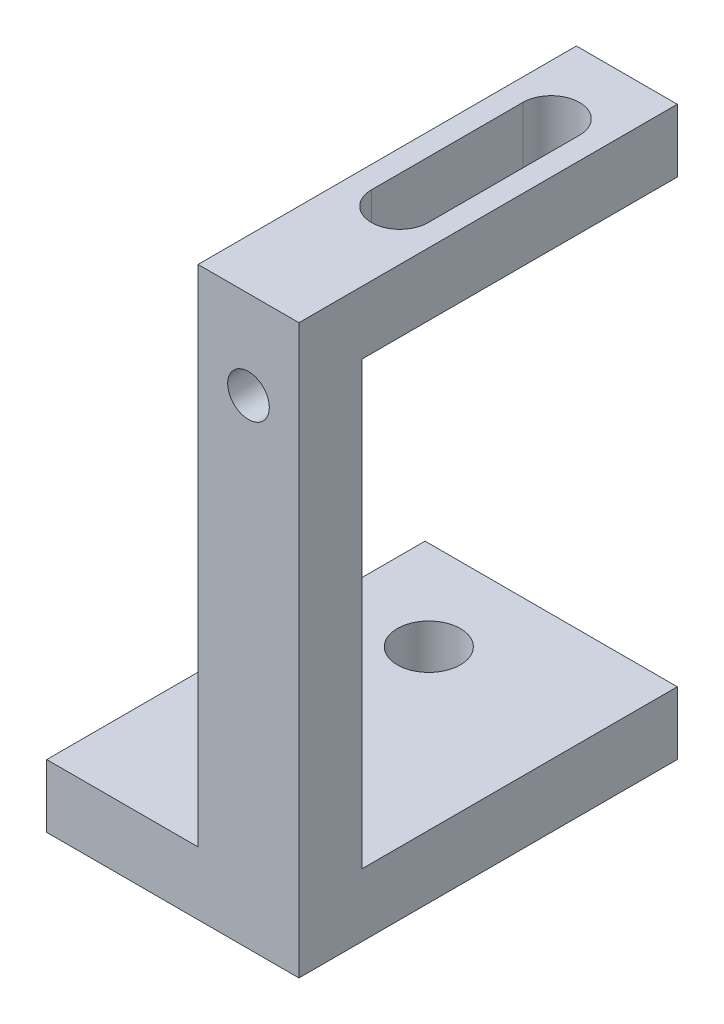
ISO-10303-21;
HEADER;
FILE_DESCRIPTION(('STEP AP214'),'2;1');
FILE_NAME('part.step','',(''),(''),'','','');
FILE_SCHEMA(('AUTOMOTIVE_DESIGN { 1 0 10303 214 1 1 1 1 }'));
ENDSEC;
DATA;
#1=APPLICATION_CONTEXT('core data for automotive mechanical design processes');
#2=APPLICATION_PROTOCOL_DEFINITION('international standard','automotive_design',2000,#1);
#3=PRODUCT_CONTEXT('',#1,'mechanical');
#4=PRODUCT('Part','Part','',(#3));
#5=PRODUCT_RELATED_PRODUCT_CATEGORY('part','',(#4));
#6=PRODUCT_DEFINITION_FORMATION('','',#4);
#7=PRODUCT_DEFINITION_CONTEXT('part definition',#1,'design');
#8=PRODUCT_DEFINITION('design','',#6,#7);
#9=PRODUCT_DEFINITION_SHAPE('','',#8);
#10=(LENGTH_UNIT() NAMED_UNIT(*) SI_UNIT(.MILLI.,.METRE.));
#11=(NAMED_UNIT(*) PLANE_ANGLE_UNIT() SI_UNIT($,.RADIAN.));
#12=(NAMED_UNIT(*) SI_UNIT($,.STERADIAN.) SOLID_ANGLE_UNIT());
#13=UNCERTAINTY_MEASURE_WITH_UNIT(LENGTH_MEASURE(1.E-05),#10,'distance_accuracy_value','');
#14=(GEOMETRIC_REPRESENTATION_CONTEXT(3) GLOBAL_UNCERTAINTY_ASSIGNED_CONTEXT((#13)) GLOBAL_UNIT_ASSIGNED_CONTEXT((#10,
#11,#12)) REPRESENTATION_CONTEXT('',''));
#15=CARTESIAN_POINT('',(0.,0.,0.));
#16=DIRECTION('',(0.,0.,1.));
#17=DIRECTION('',(1.,0.,0.));
#18=AXIS2_PLACEMENT_3D('',#15,#16,#17);
#19=CARTESIAN_POINT('',(0.,0.,10.));
#20=DIRECTION('',(1.,0.,0.));
#21=DIRECTION('',(0.,1.,0.));
#22=AXIS2_PLACEMENT_3D('',#19,#20,#21);
#23=PLANE('',#22);
#24=DIRECTION('',(0.,0.,-1.));
#25=VECTOR('',#24,1.);
#26=CARTESIAN_POINT('',(0.,15.,5.));
#27=LINE('',#26,#25);
#28=CARTESIAN_POINT('',(0.,15.,5.));
#29=VERTEX_POINT('',#28);
#30=CARTESIAN_POINT('',(0.,15.,-20.));
#31=VERTEX_POINT('',#30);
#32=EDGE_CURVE('E212',#29,#31,#27,.T.);
#33=ORIENTED_EDGE('',*,*,#32,.F.);
#34=DIRECTION('',(0.,1.,0.));
#35=VECTOR('',#34,1.);
#36=CARTESIAN_POINT('',(0.,0.,5.));
#37=LINE('',#36,#35);
#38=CARTESIAN_POINT('',(0.,-20.,5.));
#39=VERTEX_POINT('',#38);
#40=EDGE_CURVE('E209',#39,#29,#37,.T.);
#41=ORIENTED_EDGE('',*,*,#40,.F.);
#42=DIRECTION('',(0.,0.,-1.));
#43=VECTOR('',#42,1.);
#44=CARTESIAN_POINT('',(0.,-20.,5.));
#45=LINE('',#44,#43);
#46=CARTESIAN_POINT('',(0.,-20.,10.));
#47=VERTEX_POINT('',#46);
#48=EDGE_CURVE('E203',#47,#39,#45,.T.);
#49=ORIENTED_EDGE('',*,*,#48,.F.);
#50=DIRECTION('',(0.,-1.,0.));
#51=VECTOR('',#50,1.);
#52=CARTESIAN_POINT('',(0.,0.,10.));
#53=LINE('',#52,#51);
#54=CARTESIAN_POINT('',(0.,20.,10.));
#55=VERTEX_POINT('',#54);
#56=EDGE_CURVE('E218',#55,#47,#53,.T.);
#57=ORIENTED_EDGE('',*,*,#56,.F.);
#58=DIRECTION('',(0.,0.,-1.));
#59=VECTOR('',#58,1.);
#60=CARTESIAN_POINT('',(0.,20.,10.));
#61=LINE('',#60,#59);
#62=CARTESIAN_POINT('',(0.,20.,-20.));
#63=VERTEX_POINT('',#62);
#64=EDGE_CURVE('E224',#55,#63,#61,.T.);
#65=ORIENTED_EDGE('',*,*,#64,.T.);
#66=DIRECTION('',(0.,1.,0.));
#67=VECTOR('',#66,1.);
#68=CARTESIAN_POINT('',(0.,20.,-20.));
#69=LINE('',#68,#67);
#70=EDGE_CURVE('E164',#31,#63,#69,.T.);
#71=ORIENTED_EDGE('',*,*,#70,.F.);
#72=EDGE_LOOP('',(#33,#41,#49,#57,#65,#71));
#73=FACE_BOUND('',#72,.T.);
#74=ADVANCED_FACE('F36',(#73),#23,.F.);
#75=CARTESIAN_POINT('',(8.,0.,10.));
#76=DIRECTION('',(-1.,0.,0.));
#77=DIRECTION('',(0.,-1.,0.));
#78=AXIS2_PLACEMENT_3D('',#75,#76,#77);
#79=PLANE('',#78);
#80=DIRECTION('',(0.,1.,0.));
#81=VECTOR('',#80,1.);
#82=CARTESIAN_POINT('',(8.,0.,10.));
#83=LINE('',#82,#81);
#84=CARTESIAN_POINT('',(8.,-25.,10.));
#85=VERTEX_POINT('',#84);
#86=CARTESIAN_POINT('',(8.,20.,10.));
#87=VERTEX_POINT('',#86);
#88=EDGE_CURVE('E220',#85,#87,#83,.T.);
#89=ORIENTED_EDGE('',*,*,#88,.F.);
#90=DIRECTION('',(0.,0.,1.));
#91=VECTOR('',#90,1.);
#92=CARTESIAN_POINT('',(8.,-25.,10.));
#93=LINE('',#92,#91);
#94=CARTESIAN_POINT('',(8.,-25.,-20.));
#95=VERTEX_POINT('',#94);
#96=EDGE_CURVE('E177',#95,#85,#93,.T.);
#97=ORIENTED_EDGE('',*,*,#96,.F.);
#98=DIRECTION('',(0.,1.,0.));
#99=VECTOR('',#98,1.);
#100=CARTESIAN_POINT('',(8.,-25.,-20.));
#101=LINE('',#100,#99);
#102=CARTESIAN_POINT('',(8.,-20.,-20.));
#103=VERTEX_POINT('',#102);
#104=EDGE_CURVE('E187',#95,#103,#101,.T.);
#105=ORIENTED_EDGE('',*,*,#104,.T.);
#106=DIRECTION('',(0.,0.,1.));
#107=VECTOR('',#106,1.);
#108=CARTESIAN_POINT('',(8.,-20.,10.));
#109=LINE('',#108,#107);
#110=CARTESIAN_POINT('',(8.,-20.,5.));
#111=VERTEX_POINT('',#110);
#112=EDGE_CURVE('E174',#103,#111,#109,.T.);
#113=ORIENTED_EDGE('',*,*,#112,.T.);
#114=DIRECTION('',(0.,1.,0.));
#115=VECTOR('',#114,1.);
#116=CARTESIAN_POINT('',(8.,0.,5.));
#117=LINE('',#116,#115);
#118=CARTESIAN_POINT('',(8.,15.,5.));
#119=VERTEX_POINT('',#118);
#120=EDGE_CURVE('E228',#111,#119,#117,.T.);
#121=ORIENTED_EDGE('',*,*,#120,.T.);
#122=DIRECTION('',(0.,0.,-1.));
#123=VECTOR('',#122,1.);
#124=CARTESIAN_POINT('',(8.,15.,9.99999999999998));
#125=LINE('',#124,#123);
#126=CARTESIAN_POINT('',(8.,15.,-20.));
#127=VERTEX_POINT('',#126);
#128=EDGE_CURVE('E216',#119,#127,#125,.T.);
#129=ORIENTED_EDGE('',*,*,#128,.T.);
#130=DIRECTION('',(0.,-1.,0.));
#131=VECTOR('',#130,1.);
#132=CARTESIAN_POINT('',(8.,20.,-20.));
#133=LINE('',#132,#131);
#134=CARTESIAN_POINT('',(8.,20.,-20.));
#135=VERTEX_POINT('',#134);
#136=EDGE_CURVE('E156',#135,#127,#133,.T.);
#137=ORIENTED_EDGE('',*,*,#136,.F.);
#138=DIRECTION('',(0.,0.,-1.));
#139=VECTOR('',#138,1.);
#140=CARTESIAN_POINT('',(8.,20.,10.));
#141=LINE('',#140,#139);
#142=EDGE_CURVE('E226',#87,#135,#141,.T.);
#143=ORIENTED_EDGE('',*,*,#142,.F.);
#144=EDGE_LOOP('',(#89,#97,#105,#113,#121,#129,#137,#143));
#145=FACE_BOUND('',#144,.T.);
#146=ADVANCED_FACE('F254',(#145),#79,.F.);
#147=CARTESIAN_POINT('',(0.,20.,10.));
#148=DIRECTION('',(0.,-1.,0.));
#149=DIRECTION('',(0.,0.,-1.));
#150=AXIS2_PLACEMENT_3D('',#147,#148,#149);
#151=PLANE('',#150);
#152=DIRECTION('',(0.,0.,1.));
#153=VECTOR('',#152,1.);
#154=CARTESIAN_POINT('',(1.75,20.,-14.));
#155=LINE('',#154,#153);
#156=CARTESIAN_POINT('',(1.75,20.,-14.));
#157=VERTEX_POINT('',#156);
#158=CARTESIAN_POINT('',(1.75,20.,-2.));
#159=VERTEX_POINT('',#158);
#160=EDGE_CURVE('E142',#157,#159,#155,.T.);
#161=ORIENTED_EDGE('',*,*,#160,.F.);
#162=CARTESIAN_POINT('',(4.,20.,-14.));
#163=DIRECTION('',(0.,1.,0.));
#164=DIRECTION('',(0.,0.,1.));
#165=AXIS2_PLACEMENT_3D('',#162,#163,#164);
#166=CIRCLE('',#165,2.25);
#167=CARTESIAN_POINT('',(6.25,20.,-14.));
#168=VERTEX_POINT('',#167);
#169=EDGE_CURVE('E50',#168,#157,#166,.T.);
#170=ORIENTED_EDGE('',*,*,#169,.F.);
#171=DIRECTION('',(0.,0.,-1.));
#172=VECTOR('',#171,1.);
#173=CARTESIAN_POINT('',(6.25,20.,-14.));
#174=LINE('',#173,#172);
#175=CARTESIAN_POINT('',(6.25,20.,-2.));
#176=VERTEX_POINT('',#175);
#177=EDGE_CURVE('E149',#176,#168,#174,.T.);
#178=ORIENTED_EDGE('',*,*,#177,.F.);
#179=CARTESIAN_POINT('',(4.,20.,-2.));
#180=DIRECTION('',(0.,1.,0.));
#181=DIRECTION('',(0.,0.,1.));
#182=AXIS2_PLACEMENT_3D('',#179,#180,#181);
#183=CIRCLE('',#182,2.25);
#184=EDGE_CURVE('E133',#159,#176,#183,.T.);
#185=ORIENTED_EDGE('',*,*,#184,.F.);
#186=EDGE_LOOP('',(#161,#170,#178,#185));
#187=FACE_BOUND('',#186,.T.);
#188=ORIENTED_EDGE('',*,*,#142,.T.);
#189=DIRECTION('',(1.,0.,0.));
#190=VECTOR('',#189,1.);
#191=CARTESIAN_POINT('',(8.,20.,-20.));
#192=LINE('',#191,#190);
#193=EDGE_CURVE('E167',#63,#135,#192,.T.);
#194=ORIENTED_EDGE('',*,*,#193,.F.);
#195=ORIENTED_EDGE('',*,*,#64,.F.);
#196=DIRECTION('',(-1.,0.,0.));
#197=VECTOR('',#196,1.);
#198=CARTESIAN_POINT('',(0.,20.,10.));
#199=LINE('',#198,#197);
#200=EDGE_CURVE('E222',#87,#55,#199,.T.);
#201=ORIENTED_EDGE('',*,*,#200,.F.);
#202=EDGE_LOOP('',(#188,#194,#195,#201));
#203=FACE_BOUND('',#202,.T.);
#204=ADVANCED_FACE('F146',(#187,#203),#151,.F.);
#205=CARTESIAN_POINT('',(0.,0.,10.));
#206=DIRECTION('',(0.,0.,-1.));
#207=DIRECTION('',(-1.,0.,0.));
#208=AXIS2_PLACEMENT_3D('',#205,#206,#207);
#209=PLANE('',#208);
#210=CARTESIAN_POINT('',(4.,13.,10.));
#211=DIRECTION('',(0.,0.,1.));
#212=DIRECTION('',(1.,0.,0.));
#213=AXIS2_PLACEMENT_3D('',#210,#211,#212);
#214=CIRCLE('',#213,1.65);
#215=CARTESIAN_POINT('',(5.65,13.,10.));
#216=VERTEX_POINT('',#215);
#217=EDGE_CURVE('E406',#216,#216,#214,.T.);
#218=ORIENTED_EDGE('',*,*,#217,.F.);
#219=EDGE_LOOP('',(#218));
#220=FACE_BOUND('',#219,.T.);
#221=ORIENTED_EDGE('',*,*,#56,.T.);
#222=DIRECTION('',(-1.,0.,0.));
#223=VECTOR('',#222,1.);
#224=CARTESIAN_POINT('',(8.,-20.,10.));
#225=LINE('',#224,#223);
#226=CARTESIAN_POINT('',(-12.,-20.,10.));
#227=VERTEX_POINT('',#226);
#228=EDGE_CURVE('E190',#47,#227,#225,.T.);
#229=ORIENTED_EDGE('',*,*,#228,.T.);
#230=DIRECTION('',(0.,1.,0.));
#231=VECTOR('',#230,1.);
#232=CARTESIAN_POINT('',(-12.,-25.,10.));
#233=LINE('',#232,#231);
#234=CARTESIAN_POINT('',(-12.,-25.,10.));
#235=VERTEX_POINT('',#234);
#236=EDGE_CURVE('E200',#235,#227,#233,.T.);
#237=ORIENTED_EDGE('',*,*,#236,.F.);
#238=DIRECTION('',(-1.,0.,0.));
#239=VECTOR('',#238,1.);
#240=CARTESIAN_POINT('',(8.,-25.,10.));
#241=LINE('',#240,#239);
#242=EDGE_CURVE('E180',#85,#235,#241,.T.);
#243=ORIENTED_EDGE('',*,*,#242,.F.);
#244=ORIENTED_EDGE('',*,*,#88,.T.);
#245=ORIENTED_EDGE('',*,*,#200,.T.);
#246=EDGE_LOOP('',(#221,#229,#237,#243,#244,#245));
#247=FACE_BOUND('',#246,.T.);
#248=ADVANCED_FACE('F280',(#220,#247),#209,.F.);
#249=CARTESIAN_POINT('',(10.,0.,5.));
#250=DIRECTION('',(0.,0.,1.));
#251=DIRECTION('',(1.,0.,0.));
#252=AXIS2_PLACEMENT_3D('',#249,#250,#251);
#253=PLANE('',#252);
#254=CARTESIAN_POINT('',(4.,13.,5.));
#255=DIRECTION('',(0.,0.,1.));
#256=DIRECTION('',(1.,0.,0.));
#257=AXIS2_PLACEMENT_3D('',#254,#255,#256);
#258=CIRCLE('',#257,1.65);
#259=CARTESIAN_POINT('',(5.65,13.,5.));
#260=VERTEX_POINT('',#259);
#261=EDGE_CURVE('E409',#260,#260,#258,.T.);
#262=ORIENTED_EDGE('',*,*,#261,.T.);
#263=EDGE_LOOP('',(#262));
#264=FACE_BOUND('',#263,.T.);
#265=ORIENTED_EDGE('',*,*,#120,.F.);
#266=DIRECTION('',(1.,0.,0.));
#267=VECTOR('',#266,1.);
#268=CARTESIAN_POINT('',(0.,-20.,5.));
#269=LINE('',#268,#267);
#270=EDGE_CURVE('E206',#39,#111,#269,.T.);
#271=ORIENTED_EDGE('',*,*,#270,.F.);
#272=ORIENTED_EDGE('',*,*,#40,.T.);
#273=DIRECTION('',(-1.,0.,0.));
#274=VECTOR('',#273,1.);
#275=CARTESIAN_POINT('',(10.,15.,5.));
#276=LINE('',#275,#274);
#277=EDGE_CURVE('E214',#119,#29,#276,.T.);
#278=ORIENTED_EDGE('',*,*,#277,.F.);
#279=EDGE_LOOP('',(#265,#271,#272,#278));
#280=FACE_BOUND('',#279,.T.);
#281=ADVANCED_FACE('F271',(#264,#280),#253,.F.);
#282=CARTESIAN_POINT('',(10.,15.,5.));
#283=DIRECTION('',(0.,1.,0.));
#284=DIRECTION('',(0.,0.,1.));
#285=AXIS2_PLACEMENT_3D('',#282,#283,#284);
#286=PLANE('',#285);
#287=DIRECTION('',(0.,0.,-1.));
#288=VECTOR('',#287,1.);
#289=CARTESIAN_POINT('',(6.25,15.,5.));
#290=LINE('',#289,#288);
#291=CARTESIAN_POINT('',(6.25,15.,-2.));
#292=VERTEX_POINT('',#291);
#293=CARTESIAN_POINT('',(6.25,15.,-14.));
#294=VERTEX_POINT('',#293);
#295=EDGE_CURVE('E43',#292,#294,#290,.T.);
#296=ORIENTED_EDGE('',*,*,#295,.T.);
#297=CARTESIAN_POINT('',(4.,15.,-14.));
#298=DIRECTION('',(0.,1.,0.));
#299=DIRECTION('',(0.,0.,1.));
#300=AXIS2_PLACEMENT_3D('',#297,#298,#299);
#301=CIRCLE('',#300,2.25);
#302=CARTESIAN_POINT('',(1.75,15.,-14.));
#303=VERTEX_POINT('',#302);
#304=EDGE_CURVE('E11',#294,#303,#301,.T.);
#305=ORIENTED_EDGE('',*,*,#304,.T.);
#306=DIRECTION('',(0.,0.,1.));
#307=VECTOR('',#306,1.);
#308=CARTESIAN_POINT('',(1.75,15.,5.));
#309=LINE('',#308,#307);
#310=CARTESIAN_POINT('',(1.75,15.,-2.));
#311=VERTEX_POINT('',#310);
#312=EDGE_CURVE('E231',#303,#311,#309,.T.);
#313=ORIENTED_EDGE('',*,*,#312,.T.);
#314=CARTESIAN_POINT('',(4.,15.,-2.));
#315=DIRECTION('',(0.,1.,0.));
#316=DIRECTION('',(0.,0.,1.));
#317=AXIS2_PLACEMENT_3D('',#314,#315,#316);
#318=CIRCLE('',#317,2.25);
#319=EDGE_CURVE('E136',#311,#292,#318,.T.);
#320=ORIENTED_EDGE('',*,*,#319,.T.);
#321=EDGE_LOOP('',(#296,#305,#313,#320));
#322=FACE_BOUND('',#321,.T.);
#323=ORIENTED_EDGE('',*,*,#277,.T.);
#324=ORIENTED_EDGE('',*,*,#32,.T.);
#325=DIRECTION('',(-1.,0.,0.));
#326=VECTOR('',#325,1.);
#327=CARTESIAN_POINT('',(8.,15.,-20.));
#328=LINE('',#327,#326);
#329=EDGE_CURVE('E161',#127,#31,#328,.T.);
#330=ORIENTED_EDGE('',*,*,#329,.F.);
#331=ORIENTED_EDGE('',*,*,#128,.F.);
#332=EDGE_LOOP('',(#323,#324,#330,#331));
#333=FACE_BOUND('',#332,.T.);
#334=ADVANCED_FACE('F235',(#322,#333),#286,.F.);
#335=CARTESIAN_POINT('',(-12.,-25.,10.));
#336=DIRECTION('',(1.,0.,0.));
#337=DIRECTION('',(0.,0.,-1.));
#338=AXIS2_PLACEMENT_3D('',#335,#336,#337);
#339=PLANE('',#338);
#340=DIRECTION('',(0.,0.,-1.));
#341=VECTOR('',#340,1.);
#342=CARTESIAN_POINT('',(-12.,-20.,10.));
#343=LINE('',#342,#341);
#344=CARTESIAN_POINT('',(-12.,-20.,-20.));
#345=VERTEX_POINT('',#344);
#346=EDGE_CURVE('E192',#227,#345,#343,.T.);
#347=ORIENTED_EDGE('',*,*,#346,.T.);
#348=DIRECTION('',(0.,1.,0.));
#349=VECTOR('',#348,1.);
#350=CARTESIAN_POINT('',(-12.,-25.,-20.));
#351=LINE('',#350,#349);
#352=CARTESIAN_POINT('',(-12.,-25.,-20.));
#353=VERTEX_POINT('',#352);
#354=EDGE_CURVE('E197',#353,#345,#351,.T.);
#355=ORIENTED_EDGE('',*,*,#354,.F.);
#356=DIRECTION('',(0.,0.,-1.));
#357=VECTOR('',#356,1.);
#358=CARTESIAN_POINT('',(-12.,-25.,10.));
#359=LINE('',#358,#357);
#360=EDGE_CURVE('E183',#235,#353,#359,.T.);
#361=ORIENTED_EDGE('',*,*,#360,.F.);
#362=ORIENTED_EDGE('',*,*,#236,.T.);
#363=EDGE_LOOP('',(#347,#355,#361,#362));
#364=FACE_BOUND('',#363,.T.);
#365=ADVANCED_FACE('F296',(#364),#339,.F.);
#366=CARTESIAN_POINT('',(8.,-25.,-20.));
#367=DIRECTION('',(0.,0.,1.));
#368=DIRECTION('',(1.,0.,0.));
#369=AXIS2_PLACEMENT_3D('',#366,#367,#368);
#370=PLANE('',#369);
#371=DIRECTION('',(1.,0.,0.));
#372=VECTOR('',#371,1.);
#373=CARTESIAN_POINT('',(8.,-20.,-20.));
#374=LINE('',#373,#372);
#375=EDGE_CURVE('E181',#345,#103,#374,.T.);
#376=ORIENTED_EDGE('',*,*,#375,.T.);
#377=ORIENTED_EDGE('',*,*,#104,.F.);
#378=DIRECTION('',(1.,0.,0.));
#379=VECTOR('',#378,1.);
#380=CARTESIAN_POINT('',(8.,-25.,-20.));
#381=LINE('',#380,#379);
#382=EDGE_CURVE('E185',#353,#95,#381,.T.);
#383=ORIENTED_EDGE('',*,*,#382,.F.);
#384=ORIENTED_EDGE('',*,*,#354,.T.);
#385=EDGE_LOOP('',(#376,#377,#383,#384));
#386=FACE_BOUND('',#385,.T.);
#387=ADVANCED_FACE('F299',(#386),#370,.F.);
#388=CARTESIAN_POINT('',(0.,-25.,0.));
#389=DIRECTION('',(0.,1.,0.));
#390=DIRECTION('',(0.,0.,1.));
#391=AXIS2_PLACEMENT_3D('',#388,#389,#390);
#392=PLANE('',#391);
#393=CARTESIAN_POINT('',(-4.60000000000237,-25.,-12.8978974111214));
#394=DIRECTION('',(0.,1.,0.));
#395=DIRECTION('',(0.,0.,1.));
#396=AXIS2_PLACEMENT_3D('',#393,#394,#395);
#397=CIRCLE('',#396,2.5);
#398=CARTESIAN_POINT('',(-4.60000000000237,-25.,-10.3978974111214));
#399=VERTEX_POINT('',#398);
#400=EDGE_CURVE('E171',#399,#399,#397,.T.);
#401=ORIENTED_EDGE('',*,*,#400,.T.);
#402=EDGE_LOOP('',(#401));
#403=FACE_BOUND('',#402,.T.);
#404=ORIENTED_EDGE('',*,*,#96,.T.);
#405=ORIENTED_EDGE('',*,*,#242,.T.);
#406=ORIENTED_EDGE('',*,*,#360,.T.);
#407=ORIENTED_EDGE('',*,*,#382,.T.);
#408=EDGE_LOOP('',(#404,#405,#406,#407));
#409=FACE_BOUND('',#408,.T.);
#410=ADVANCED_FACE('F303',(#403,#409),#392,.F.);
#411=CARTESIAN_POINT('',(0.,-20.,0.));
#412=DIRECTION('',(0.,1.,0.));
#413=DIRECTION('',(0.,0.,1.));
#414=AXIS2_PLACEMENT_3D('',#411,#412,#413);
#415=PLANE('',#414);
#416=CARTESIAN_POINT('',(-4.60000000000237,-20.,-12.8978974111214));
#417=DIRECTION('',(0.,1.,0.));
#418=DIRECTION('',(0.,0.,1.));
#419=AXIS2_PLACEMENT_3D('',#416,#417,#418);
#420=CIRCLE('',#419,2.5);
#421=CARTESIAN_POINT('',(-4.60000000000237,-20.,-10.3978974111214));
#422=VERTEX_POINT('',#421);
#423=EDGE_CURVE('E170',#422,#422,#420,.T.);
#424=ORIENTED_EDGE('',*,*,#423,.F.);
#425=EDGE_LOOP('',(#424));
#426=FACE_BOUND('',#425,.T.);
#427=ORIENTED_EDGE('',*,*,#228,.F.);
#428=ORIENTED_EDGE('',*,*,#48,.T.);
#429=ORIENTED_EDGE('',*,*,#270,.T.);
#430=ORIENTED_EDGE('',*,*,#112,.F.);
#431=ORIENTED_EDGE('',*,*,#375,.F.);
#432=ORIENTED_EDGE('',*,*,#346,.F.);
#433=EDGE_LOOP('',(#427,#428,#429,#430,#431,#432));
#434=FACE_BOUND('',#433,.T.);
#435=ADVANCED_FACE('F275',(#426,#434),#415,.T.);
#436=CARTESIAN_POINT('',(-4.60000000000237,-25.,-12.8978974111214));
#437=DIRECTION('',(0.,1.,0.));
#438=DIRECTION('',(0.,0.,1.));
#439=AXIS2_PLACEMENT_3D('',#436,#437,#438);
#440=CYLINDRICAL_SURFACE('',#439,2.5);
#441=ORIENTED_EDGE('',*,*,#400,.F.);
#442=EDGE_LOOP('',(#441));
#443=FACE_BOUND('',#442,.T.);
#444=ORIENTED_EDGE('',*,*,#423,.T.);
#445=EDGE_LOOP('',(#444));
#446=FACE_BOUND('',#445,.T.);
#447=ADVANCED_FACE('F249',(#443,#446),#440,.F.);
#448=CARTESIAN_POINT('',(0.,0.,-20.));
#449=DIRECTION('',(0.,0.,-1.));
#450=DIRECTION('',(-1.,0.,0.));
#451=AXIS2_PLACEMENT_3D('',#448,#449,#450);
#452=PLANE('',#451);
#453=ORIENTED_EDGE('',*,*,#136,.T.);
#454=ORIENTED_EDGE('',*,*,#329,.T.);
#455=ORIENTED_EDGE('',*,*,#70,.T.);
#456=ORIENTED_EDGE('',*,*,#193,.T.);
#457=EDGE_LOOP('',(#453,#454,#455,#456));
#458=FACE_BOUND('',#457,.T.);
#459=ADVANCED_FACE('F242',(#458),#452,.T.);
#460=CARTESIAN_POINT('',(4.,10.,-14.));
#461=DIRECTION('',(0.,1.,0.));
#462=DIRECTION('',(0.,0.,1.));
#463=AXIS2_PLACEMENT_3D('',#460,#461,#462);
#464=CYLINDRICAL_SURFACE('',#463,2.25);
#465=DIRECTION('',(0.,1.,0.));
#466=VECTOR('',#465,1.);
#467=CARTESIAN_POINT('',(6.25,10.,-14.));
#468=LINE('',#467,#466);
#469=EDGE_CURVE('E154',#294,#168,#468,.T.);
#470=ORIENTED_EDGE('',*,*,#469,.T.);
#471=ORIENTED_EDGE('',*,*,#169,.T.);
#472=DIRECTION('',(0.,1.,0.));
#473=VECTOR('',#472,1.);
#474=CARTESIAN_POINT('',(1.75,10.,-14.));
#475=LINE('',#474,#473);
#476=EDGE_CURVE('E139',#303,#157,#475,.T.);
#477=ORIENTED_EDGE('',*,*,#476,.F.);
#478=ORIENTED_EDGE('',*,*,#304,.F.);
#479=EDGE_LOOP('',(#470,#471,#477,#478));
#480=FACE_BOUND('',#479,.T.);
#481=ADVANCED_FACE('F240',(#480),#464,.F.);
#482=CARTESIAN_POINT('',(6.25,10.,-14.));
#483=DIRECTION('',(1.,0.,0.));
#484=DIRECTION('',(0.,0.,-1.));
#485=AXIS2_PLACEMENT_3D('',#482,#483,#484);
#486=PLANE('',#485);
#487=DIRECTION('',(0.,1.,0.));
#488=VECTOR('',#487,1.);
#489=CARTESIAN_POINT('',(6.25,10.,-2.));
#490=LINE('',#489,#488);
#491=EDGE_CURVE('E138',#292,#176,#490,.T.);
#492=ORIENTED_EDGE('',*,*,#491,.T.);
#493=ORIENTED_EDGE('',*,*,#177,.T.);
#494=ORIENTED_EDGE('',*,*,#469,.F.);
#495=ORIENTED_EDGE('',*,*,#295,.F.);
#496=EDGE_LOOP('',(#492,#493,#494,#495));
#497=FACE_BOUND('',#496,.T.);
#498=ADVANCED_FACE('F239',(#497),#486,.F.);
#499=CARTESIAN_POINT('',(4.,10.,-2.));
#500=DIRECTION('',(0.,1.,0.));
#501=DIRECTION('',(0.,0.,1.));
#502=AXIS2_PLACEMENT_3D('',#499,#500,#501);
#503=CYLINDRICAL_SURFACE('',#502,2.25);
#504=DIRECTION('',(0.,1.,0.));
#505=VECTOR('',#504,1.);
#506=CARTESIAN_POINT('',(1.75,10.,-2.));
#507=LINE('',#506,#505);
#508=EDGE_CURVE('E58',#311,#159,#507,.T.);
#509=ORIENTED_EDGE('',*,*,#508,.T.);
#510=ORIENTED_EDGE('',*,*,#184,.T.);
#511=ORIENTED_EDGE('',*,*,#491,.F.);
#512=ORIENTED_EDGE('',*,*,#319,.F.);
#513=EDGE_LOOP('',(#509,#510,#511,#512));
#514=FACE_BOUND('',#513,.T.);
#515=ADVANCED_FACE('F130',(#514),#503,.F.);
#516=CARTESIAN_POINT('',(1.75,10.,-14.));
#517=DIRECTION('',(-1.,0.,0.));
#518=DIRECTION('',(0.,0.,1.));
#519=AXIS2_PLACEMENT_3D('',#516,#517,#518);
#520=PLANE('',#519);
#521=ORIENTED_EDGE('',*,*,#476,.T.);
#522=ORIENTED_EDGE('',*,*,#160,.T.);
#523=ORIENTED_EDGE('',*,*,#508,.F.);
#524=ORIENTED_EDGE('',*,*,#312,.F.);
#525=EDGE_LOOP('',(#521,#522,#523,#524));
#526=FACE_BOUND('',#525,.T.);
#527=ADVANCED_FACE('F143',(#526),#520,.F.);
#528=CARTESIAN_POINT('',(4.,13.,10.));
#529=DIRECTION('',(0.,0.,1.));
#530=DIRECTION('',(1.,0.,0.));
#531=AXIS2_PLACEMENT_3D('',#528,#529,#530);
#532=CYLINDRICAL_SURFACE('',#531,1.65);
#533=ORIENTED_EDGE('',*,*,#217,.T.);
#534=EDGE_LOOP('',(#533));
#535=FACE_BOUND('',#534,.T.);
#536=ORIENTED_EDGE('',*,*,#261,.F.);
#537=EDGE_LOOP('',(#536));
#538=FACE_BOUND('',#537,.T.);
#539=ADVANCED_FACE('F373',(#535,#538),#532,.F.);
#540=CLOSED_SHELL('',(#74,#146,#204,#248,#281,#334,#365,#387,#410,#435,#447,#459,#481,#498,#515,
#527,#539));
#541=MANIFOLD_SOLID_BREP('B2',#540);
#542=ADVANCED_BREP_SHAPE_REPRESENTATION('',(#18,#541),#14);
#543=SHAPE_DEFINITION_REPRESENTATION(#9,#542);
ENDSEC;
END-ISO-10303-21;
